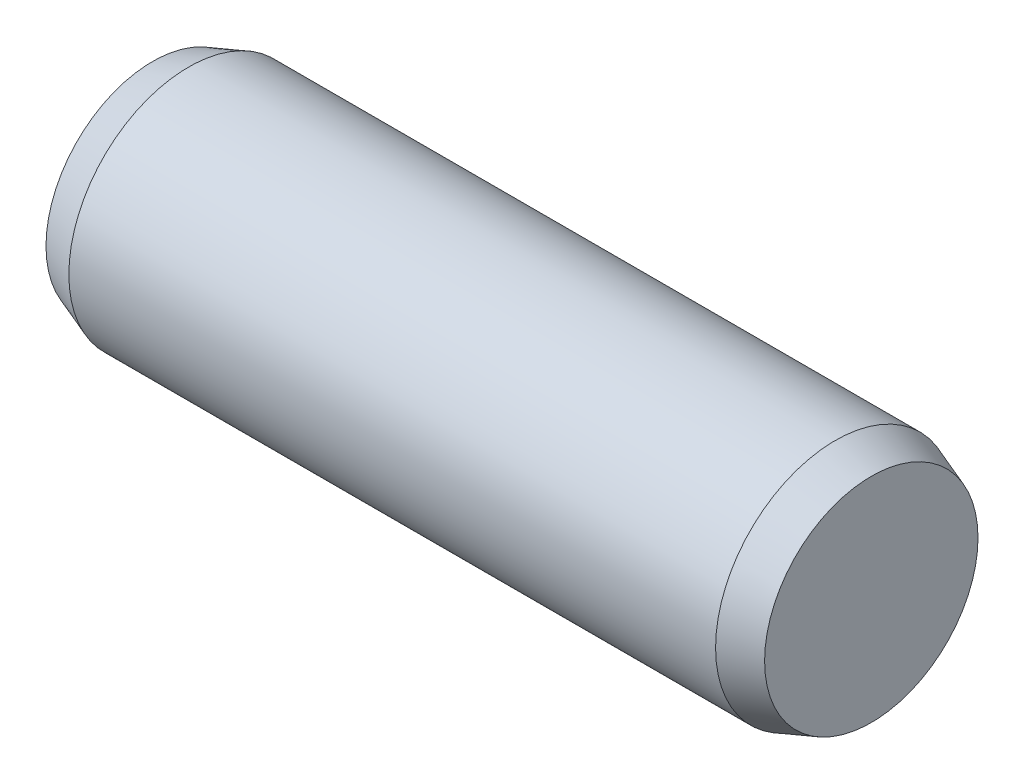
ISO-10303-21;
HEADER;
FILE_DESCRIPTION(('STEP AP214'),'2;1');
FILE_NAME('part.step','',(''),(''),'','','');
FILE_SCHEMA(('AUTOMOTIVE_DESIGN { 1 0 10303 214 1 1 1 1 }'));
ENDSEC;
DATA;
#1=APPLICATION_CONTEXT('core data for automotive mechanical design processes');
#2=APPLICATION_PROTOCOL_DEFINITION('international standard','automotive_design',2000,#1);
#3=PRODUCT_CONTEXT('',#1,'mechanical');
#4=PRODUCT('Part','Part','',(#3));
#5=PRODUCT_RELATED_PRODUCT_CATEGORY('part','',(#4));
#6=PRODUCT_DEFINITION_FORMATION('','',#4);
#7=PRODUCT_DEFINITION_CONTEXT('part definition',#1,'design');
#8=PRODUCT_DEFINITION('design','',#6,#7);
#9=PRODUCT_DEFINITION_SHAPE('','',#8);
#10=(LENGTH_UNIT() NAMED_UNIT(*) SI_UNIT(.MILLI.,.METRE.));
#11=(NAMED_UNIT(*) PLANE_ANGLE_UNIT() SI_UNIT($,.RADIAN.));
#12=(NAMED_UNIT(*) SI_UNIT($,.STERADIAN.) SOLID_ANGLE_UNIT());
#13=UNCERTAINTY_MEASURE_WITH_UNIT(LENGTH_MEASURE(1.E-05),#10,'distance_accuracy_value','');
#14=(GEOMETRIC_REPRESENTATION_CONTEXT(3) GLOBAL_UNCERTAINTY_ASSIGNED_CONTEXT((#13)) GLOBAL_UNIT_ASSIGNED_CONTEXT((#10,
#11,#12)) REPRESENTATION_CONTEXT('',''));
#15=CARTESIAN_POINT('',(0.,0.,0.));
#16=DIRECTION('',(0.,0.,1.));
#17=DIRECTION('',(1.,0.,0.));
#18=AXIS2_PLACEMENT_3D('',#15,#16,#17);
#19=CARTESIAN_POINT('',(3.,0.,0.));
#20=DIRECTION('',(1.,0.,0.));
#21=DIRECTION('',(0.,0.,-1.));
#22=AXIS2_PLACEMENT_3D('',#19,#20,#21);
#23=PLANE('',#22);
#24=CARTESIAN_POINT('',(3.00000000004275,0.,0.));
#25=DIRECTION('',(-1.,0.,0.));
#26=DIRECTION('',(0.,0.,1.));
#27=AXIS2_PLACEMENT_3D('',#24,#25,#26);
#28=CIRCLE('',#27,0.890908929733314);
#29=CARTESIAN_POINT('',(3.00000000004275,0.,0.890908929733314));
#30=VERTEX_POINT('',#29);
#31=EDGE_CURVE('E18',#30,#30,#28,.T.);
#32=ORIENTED_EDGE('',*,*,#31,.F.);
#33=EDGE_LOOP('',(#32));
#34=FACE_BOUND('',#33,.T.);
#35=ADVANCED_FACE('F15',(#34),#23,.T.);
#36=CARTESIAN_POINT('',(-3.,0.,0.));
#37=DIRECTION('',(1.,0.,0.));
#38=DIRECTION('',(0.,0.,-1.));
#39=AXIS2_PLACEMENT_3D('',#36,#37,#38);
#40=PLANE('',#39);
#41=CARTESIAN_POINT('',(-2.9999999999859,0.,0.));
#42=DIRECTION('',(1.,0.,0.));
#43=DIRECTION('',(0.,0.,-1.));
#44=AXIS2_PLACEMENT_3D('',#41,#42,#43);
#45=CIRCLE('',#44,0.890908929733314);
#46=CARTESIAN_POINT('',(-2.9999999999859,0.,-0.890908929733314));
#47=VERTEX_POINT('',#46);
#48=EDGE_CURVE('E27',#47,#47,#45,.T.);
#49=ORIENTED_EDGE('',*,*,#48,.F.);
#50=EDGE_LOOP('',(#49));
#51=FACE_BOUND('',#50,.T.);
#52=ADVANCED_FACE('F38',(#51),#40,.F.);
#53=CARTESIAN_POINT('',(2.69999999989068,0.,0.));
#54=DIRECTION('',(-1.,0.,0.));
#55=DIRECTION('',(0.,0.,1.));
#56=AXIS2_PLACEMENT_3D('',#53,#54,#55);
#57=CONICAL_SURFACE('',#56,1.00010000005568,0.349065850361069);
#58=CARTESIAN_POINT('',(2.7,0.,0.));
#59=DIRECTION('',(-1.,0.,0.));
#60=DIRECTION('',(0.,0.,1.));
#61=AXIS2_PLACEMENT_3D('',#58,#59,#60);
#62=CIRCLE('',#61,1.0001);
#63=CARTESIAN_POINT('',(2.7,0.,1.0001));
#64=VERTEX_POINT('',#63);
#65=EDGE_CURVE('E22',#64,#64,#62,.T.);
#66=ORIENTED_EDGE('',*,*,#65,.F.);
#67=EDGE_LOOP('',(#66));
#68=FACE_BOUND('',#67,.T.);
#69=ORIENTED_EDGE('',*,*,#31,.T.);
#70=EDGE_LOOP('',(#69));
#71=FACE_BOUND('',#70,.T.);
#72=ADVANCED_FACE('F35',(#68,#71),#57,.T.);
#73=CARTESIAN_POINT('',(-2.70000000006121,0.,0.));
#74=DIRECTION('',(1.,0.,0.));
#75=DIRECTION('',(0.,0.,-1.));
#76=AXIS2_PLACEMENT_3D('',#73,#74,#75);
#77=CONICAL_SURFACE('',#76,1.00009999997042,0.349065850353687);
#78=CARTESIAN_POINT('',(-2.7,0.,0.));
#79=DIRECTION('',(-1.,0.,0.));
#80=DIRECTION('',(0.,0.,1.));
#81=AXIS2_PLACEMENT_3D('',#78,#79,#80);
#82=CIRCLE('',#81,1.0001);
#83=CARTESIAN_POINT('',(-2.7,0.,1.0001));
#84=VERTEX_POINT('',#83);
#85=EDGE_CURVE('E10',#84,#84,#82,.F.);
#86=ORIENTED_EDGE('',*,*,#85,.F.);
#87=EDGE_LOOP('',(#86));
#88=FACE_BOUND('',#87,.T.);
#89=ORIENTED_EDGE('',*,*,#48,.T.);
#90=EDGE_LOOP('',(#89));
#91=FACE_BOUND('',#90,.T.);
#92=ADVANCED_FACE('F46',(#88,#91),#77,.T.);
#93=CARTESIAN_POINT('',(3.,0.,0.));
#94=DIRECTION('',(-1.,0.,0.));
#95=DIRECTION('',(0.,0.,1.));
#96=AXIS2_PLACEMENT_3D('',#93,#94,#95);
#97=CYLINDRICAL_SURFACE('',#96,1.0001);
#98=ORIENTED_EDGE('',*,*,#85,.T.);
#99=EDGE_LOOP('',(#98));
#100=FACE_BOUND('',#99,.T.);
#101=ORIENTED_EDGE('',*,*,#65,.T.);
#102=EDGE_LOOP('',(#101));
#103=FACE_BOUND('',#102,.T.);
#104=ADVANCED_FACE('F44',(#100,#103),#97,.T.);
#105=CLOSED_SHELL('',(#35,#52,#72,#92,#104));
#106=MANIFOLD_SOLID_BREP('B1',#105);
#107=ADVANCED_BREP_SHAPE_REPRESENTATION('',(#18,#106),#14);
#108=SHAPE_DEFINITION_REPRESENTATION(#9,#107);
ENDSEC;
END-ISO-10303-21;
